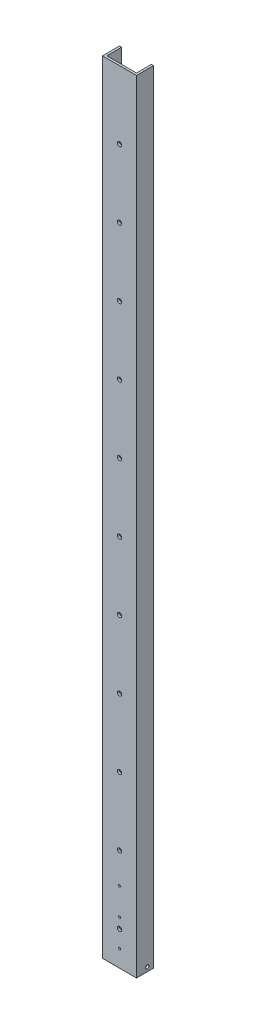
ISO-10303-21;
HEADER;
FILE_DESCRIPTION(('STEP AP214'),'2;1');
FILE_NAME('part.step','',(''),(''),'','','');
FILE_SCHEMA(('AUTOMOTIVE_DESIGN { 1 0 10303 214 1 1 1 1 }'));
ENDSEC;
DATA;
#1=APPLICATION_CONTEXT('core data for automotive mechanical design processes');
#2=APPLICATION_PROTOCOL_DEFINITION('international standard','automotive_design',2000,#1);
#3=PRODUCT_CONTEXT('',#1,'mechanical');
#4=PRODUCT('Part','Part','',(#3));
#5=PRODUCT_RELATED_PRODUCT_CATEGORY('part','',(#4));
#6=PRODUCT_DEFINITION_FORMATION('','',#4);
#7=PRODUCT_DEFINITION_CONTEXT('part definition',#1,'design');
#8=PRODUCT_DEFINITION('design','',#6,#7);
#9=PRODUCT_DEFINITION_SHAPE('','',#8);
#10=(LENGTH_UNIT() NAMED_UNIT(*) SI_UNIT(.MILLI.,.METRE.));
#11=(NAMED_UNIT(*) PLANE_ANGLE_UNIT() SI_UNIT($,.RADIAN.));
#12=(NAMED_UNIT(*) SI_UNIT($,.STERADIAN.) SOLID_ANGLE_UNIT());
#13=UNCERTAINTY_MEASURE_WITH_UNIT(LENGTH_MEASURE(1.E-05),#10,'distance_accuracy_value','');
#14=(GEOMETRIC_REPRESENTATION_CONTEXT(3) GLOBAL_UNCERTAINTY_ASSIGNED_CONTEXT((#13)) GLOBAL_UNIT_ASSIGNED_CONTEXT((#10,
#11,#12)) REPRESENTATION_CONTEXT('',''));
#15=CARTESIAN_POINT('',(0.,0.,0.));
#16=DIRECTION('',(0.,0.,1.));
#17=DIRECTION('',(1.,0.,0.));
#18=AXIS2_PLACEMENT_3D('',#15,#16,#17);
#19=CARTESIAN_POINT('',(0.,1168.4,0.));
#20=DIRECTION('',(1.,0.,0.));
#21=DIRECTION('',(0.,0.,-1.));
#22=AXIS2_PLACEMENT_3D('',#19,#20,#21);
#23=PLANE('',#22);
#24=CARTESIAN_POINT('',(0.,6.35,-15.875));
#25=DIRECTION('',(-1.,0.,0.));
#26=DIRECTION('',(0.,0.,1.));
#27=AXIS2_PLACEMENT_3D('',#24,#25,#26);
#28=CIRCLE('',#27,2.667);
#29=CARTESIAN_POINT('',(0.,6.35,-13.208));
#30=VERTEX_POINT('',#29);
#31=EDGE_CURVE('E332',#30,#30,#28,.T.);
#32=ORIENTED_EDGE('',*,*,#31,.F.);
#33=EDGE_LOOP('',(#32));
#34=FACE_BOUND('',#33,.T.);
#35=DIRECTION('',(0.,0.,1.));
#36=VECTOR('',#35,1.);
#37=CARTESIAN_POINT('',(0.,0.,0.));
#38=LINE('',#37,#36);
#39=CARTESIAN_POINT('',(0.,0.,-25.4));
#40=VERTEX_POINT('',#39);
#41=CARTESIAN_POINT('',(0.,0.,0.));
#42=VERTEX_POINT('',#41);
#43=EDGE_CURVE('E150',#40,#42,#38,.T.);
#44=ORIENTED_EDGE('',*,*,#43,.T.);
#45=DIRECTION('',(0.,-1.,0.));
#46=VECTOR('',#45,1.);
#47=CARTESIAN_POINT('',(0.,1168.4,0.));
#48=LINE('',#47,#46);
#49=CARTESIAN_POINT('',(0.,1168.4,0.));
#50=VERTEX_POINT('',#49);
#51=EDGE_CURVE('E11',#50,#42,#48,.T.);
#52=ORIENTED_EDGE('',*,*,#51,.F.);
#53=DIRECTION('',(0.,0.,1.));
#54=VECTOR('',#53,1.);
#55=CARTESIAN_POINT('',(0.,1168.4,0.));
#56=LINE('',#55,#54);
#57=CARTESIAN_POINT('',(0.,1168.4,-25.4));
#58=VERTEX_POINT('',#57);
#59=EDGE_CURVE('E173',#58,#50,#56,.T.);
#60=ORIENTED_EDGE('',*,*,#59,.F.);
#61=DIRECTION('',(0.,-1.,0.));
#62=VECTOR('',#61,1.);
#63=CARTESIAN_POINT('',(0.,1168.4,-25.4));
#64=LINE('',#63,#62);
#65=EDGE_CURVE('E146',#58,#40,#64,.T.);
#66=ORIENTED_EDGE('',*,*,#65,.T.);
#67=EDGE_LOOP('',(#44,#52,#60,#66));
#68=FACE_BOUND('',#67,.T.);
#69=ADVANCED_FACE('F38',(#34,#68),#23,.F.);
#70=CARTESIAN_POINT('',(0.,1168.4,0.));
#71=DIRECTION('',(0.,0.,-1.));
#72=DIRECTION('',(-1.,0.,0.));
#73=AXIS2_PLACEMENT_3D('',#70,#71,#72);
#74=PLANE('',#73);
#75=CARTESIAN_POINT('',(25.4,25.4,0.));
#76=DIRECTION('',(0.,0.,-1.));
#77=DIRECTION('',(-1.,0.,0.));
#78=AXIS2_PLACEMENT_3D('',#75,#76,#77);
#79=CIRCLE('',#78,1.5875);
#80=CARTESIAN_POINT('',(23.8125,25.4,0.));
#81=VERTEX_POINT('',#80);
#82=EDGE_CURVE('E227',#81,#81,#79,.F.);
#83=ORIENTED_EDGE('',*,*,#82,.F.);
#84=EDGE_LOOP('',(#83));
#85=FACE_BOUND('',#84,.T.);
#86=CARTESIAN_POINT('',(25.4,66.0202958789237,0.));
#87=DIRECTION('',(0.,0.,-1.));
#88=DIRECTION('',(-1.,0.,0.));
#89=AXIS2_PLACEMENT_3D('',#86,#87,#88);
#90=CIRCLE('',#89,1.5875);
#91=CARTESIAN_POINT('',(23.8125,66.0202958789237,0.));
#92=VERTEX_POINT('',#91);
#93=EDGE_CURVE('E315',#92,#92,#90,.F.);
#94=ORIENTED_EDGE('',*,*,#93,.F.);
#95=EDGE_LOOP('',(#94));
#96=FACE_BOUND('',#95,.T.);
#97=CARTESIAN_POINT('',(25.4,106.640591757847,0.));
#98=DIRECTION('',(0.,0.,-1.));
#99=DIRECTION('',(-1.,0.,0.));
#100=AXIS2_PLACEMENT_3D('',#97,#98,#99);
#101=CIRCLE('',#100,1.5875);
#102=CARTESIAN_POINT('',(23.8125,106.640591757847,0.));
#103=VERTEX_POINT('',#102);
#104=EDGE_CURVE('E305',#103,#103,#101,.F.);
#105=ORIENTED_EDGE('',*,*,#104,.F.);
#106=EDGE_LOOP('',(#105));
#107=FACE_BOUND('',#106,.T.);
#108=CARTESIAN_POINT('',(25.4,50.8,0.));
#109=DIRECTION('',(0.,0.,1.));
#110=DIRECTION('',(1.,0.,0.));
#111=AXIS2_PLACEMENT_3D('',#108,#109,#110);
#112=CIRCLE('',#111,3.175);
#113=CARTESIAN_POINT('',(28.575,50.8,0.));
#114=VERTEX_POINT('',#113);
#115=EDGE_CURVE('E296',#114,#114,#112,.T.);
#116=ORIENTED_EDGE('',*,*,#115,.F.);
#117=EDGE_LOOP('',(#116));
#118=FACE_BOUND('',#117,.T.);
#119=CARTESIAN_POINT('',(25.4,152.4,0.));
#120=DIRECTION('',(0.,0.,1.));
#121=DIRECTION('',(1.,0.,0.));
#122=AXIS2_PLACEMENT_3D('',#119,#120,#121);
#123=CIRCLE('',#122,3.175);
#124=CARTESIAN_POINT('',(28.575,152.4,0.));
#125=VERTEX_POINT('',#124);
#126=EDGE_CURVE('E288',#125,#125,#123,.T.);
#127=ORIENTED_EDGE('',*,*,#126,.F.);
#128=EDGE_LOOP('',(#127));
#129=FACE_BOUND('',#128,.T.);
#130=CARTESIAN_POINT('',(25.4,254.,0.));
#131=DIRECTION('',(0.,0.,1.));
#132=DIRECTION('',(1.,0.,0.));
#133=AXIS2_PLACEMENT_3D('',#130,#131,#132);
#134=CIRCLE('',#133,3.175);
#135=CARTESIAN_POINT('',(28.575,254.,0.));
#136=VERTEX_POINT('',#135);
#137=EDGE_CURVE('E280',#136,#136,#134,.T.);
#138=ORIENTED_EDGE('',*,*,#137,.F.);
#139=EDGE_LOOP('',(#138));
#140=FACE_BOUND('',#139,.T.);
#141=CARTESIAN_POINT('',(25.4,355.6,0.));
#142=DIRECTION('',(0.,0.,1.));
#143=DIRECTION('',(1.,0.,0.));
#144=AXIS2_PLACEMENT_3D('',#141,#142,#143);
#145=CIRCLE('',#144,3.17499999999997);
#146=CARTESIAN_POINT('',(28.575,355.6,0.));
#147=VERTEX_POINT('',#146);
#148=EDGE_CURVE('E272',#147,#147,#145,.T.);
#149=ORIENTED_EDGE('',*,*,#148,.F.);
#150=EDGE_LOOP('',(#149));
#151=FACE_BOUND('',#150,.T.);
#152=CARTESIAN_POINT('',(25.4,457.2,0.));
#153=DIRECTION('',(0.,0.,1.));
#154=DIRECTION('',(1.,0.,0.));
#155=AXIS2_PLACEMENT_3D('',#152,#153,#154);
#156=CIRCLE('',#155,3.17500000000002);
#157=CARTESIAN_POINT('',(28.575,457.2,0.));
#158=VERTEX_POINT('',#157);
#159=EDGE_CURVE('E264',#158,#158,#156,.T.);
#160=ORIENTED_EDGE('',*,*,#159,.F.);
#161=EDGE_LOOP('',(#160));
#162=FACE_BOUND('',#161,.T.);
#163=CARTESIAN_POINT('',(25.4,558.8,0.));
#164=DIRECTION('',(0.,0.,1.));
#165=DIRECTION('',(1.,0.,0.));
#166=AXIS2_PLACEMENT_3D('',#163,#164,#165);
#167=CIRCLE('',#166,3.175);
#168=CARTESIAN_POINT('',(28.575,558.8,0.));
#169=VERTEX_POINT('',#168);
#170=EDGE_CURVE('E256',#169,#169,#167,.T.);
#171=ORIENTED_EDGE('',*,*,#170,.F.);
#172=EDGE_LOOP('',(#171));
#173=FACE_BOUND('',#172,.T.);
#174=CARTESIAN_POINT('',(25.4,660.4,0.));
#175=DIRECTION('',(0.,0.,1.));
#176=DIRECTION('',(1.,0.,0.));
#177=AXIS2_PLACEMENT_3D('',#174,#175,#176);
#178=CIRCLE('',#177,3.175);
#179=CARTESIAN_POINT('',(28.575,660.4,0.));
#180=VERTEX_POINT('',#179);
#181=EDGE_CURVE('E248',#180,#180,#178,.T.);
#182=ORIENTED_EDGE('',*,*,#181,.F.);
#183=EDGE_LOOP('',(#182));
#184=FACE_BOUND('',#183,.T.);
#185=CARTESIAN_POINT('',(25.4,762.,0.));
#186=DIRECTION('',(0.,0.,1.));
#187=DIRECTION('',(1.,0.,0.));
#188=AXIS2_PLACEMENT_3D('',#185,#186,#187);
#189=CIRCLE('',#188,3.175);
#190=CARTESIAN_POINT('',(28.575,762.,0.));
#191=VERTEX_POINT('',#190);
#192=EDGE_CURVE('E240',#191,#191,#189,.T.);
#193=ORIENTED_EDGE('',*,*,#192,.F.);
#194=EDGE_LOOP('',(#193));
#195=FACE_BOUND('',#194,.T.);
#196=CARTESIAN_POINT('',(25.4,863.6,0.));
#197=DIRECTION('',(0.,0.,1.));
#198=DIRECTION('',(1.,0.,0.));
#199=AXIS2_PLACEMENT_3D('',#196,#197,#198);
#200=CIRCLE('',#199,3.175);
#201=CARTESIAN_POINT('',(28.575,863.6,0.));
#202=VERTEX_POINT('',#201);
#203=EDGE_CURVE('E232',#202,#202,#200,.T.);
#204=ORIENTED_EDGE('',*,*,#203,.F.);
#205=EDGE_LOOP('',(#204));
#206=FACE_BOUND('',#205,.T.);
#207=CARTESIAN_POINT('',(25.4,965.2,0.));
#208=DIRECTION('',(0.,0.,1.));
#209=DIRECTION('',(1.,0.,0.));
#210=AXIS2_PLACEMENT_3D('',#207,#208,#209);
#211=CIRCLE('',#210,3.175);
#212=CARTESIAN_POINT('',(28.575,965.2,0.));
#213=VERTEX_POINT('',#212);
#214=EDGE_CURVE('E223',#213,#213,#211,.T.);
#215=ORIENTED_EDGE('',*,*,#214,.F.);
#216=EDGE_LOOP('',(#215));
#217=FACE_BOUND('',#216,.T.);
#218=CARTESIAN_POINT('',(25.4,1066.8,0.));
#219=DIRECTION('',(0.,0.,1.));
#220=DIRECTION('',(1.,0.,0.));
#221=AXIS2_PLACEMENT_3D('',#218,#219,#220);
#222=CIRCLE('',#221,3.17499999999994);
#223=CARTESIAN_POINT('',(28.5749999999999,1066.8,0.));
#224=VERTEX_POINT('',#223);
#225=EDGE_CURVE('E224',#224,#224,#222,.T.);
#226=ORIENTED_EDGE('',*,*,#225,.F.);
#227=EDGE_LOOP('',(#226));
#228=FACE_BOUND('',#227,.T.);
#229=DIRECTION('',(1.,0.,0.));
#230=VECTOR('',#229,1.);
#231=CARTESIAN_POINT('',(0.,0.,0.));
#232=LINE('',#231,#230);
#233=CARTESIAN_POINT('',(50.8,0.,0.));
#234=VERTEX_POINT('',#233);
#235=EDGE_CURVE('E154',#42,#234,#232,.T.);
#236=ORIENTED_EDGE('',*,*,#235,.T.);
#237=DIRECTION('',(0.,-1.,0.));
#238=VECTOR('',#237,1.);
#239=CARTESIAN_POINT('',(50.8,1168.4,0.));
#240=LINE('',#239,#238);
#241=CARTESIAN_POINT('',(50.8,1168.4,0.));
#242=VERTEX_POINT('',#241);
#243=EDGE_CURVE('E48',#242,#234,#240,.T.);
#244=ORIENTED_EDGE('',*,*,#243,.F.);
#245=DIRECTION('',(1.,0.,0.));
#246=VECTOR('',#245,1.);
#247=CARTESIAN_POINT('',(0.,1168.4,0.));
#248=LINE('',#247,#246);
#249=EDGE_CURVE('E107',#50,#242,#248,.T.);
#250=ORIENTED_EDGE('',*,*,#249,.F.);
#251=ORIENTED_EDGE('',*,*,#51,.T.);
#252=EDGE_LOOP('',(#236,#244,#250,#251));
#253=FACE_BOUND('',#252,.T.);
#254=ADVANCED_FACE('F361',(#85,#96,#107,#118,#129,#140,#151,#162,#173,#184,#195,#206,#217,#228,
#253),#74,.F.);
#255=CARTESIAN_POINT('',(50.8,1168.4,0.));
#256=DIRECTION('',(-1.,0.,0.));
#257=DIRECTION('',(0.,0.,1.));
#258=AXIS2_PLACEMENT_3D('',#255,#256,#257);
#259=PLANE('',#258);
#260=CARTESIAN_POINT('',(50.8,6.35,-15.875));
#261=DIRECTION('',(-1.,0.,0.));
#262=DIRECTION('',(0.,0.,1.));
#263=AXIS2_PLACEMENT_3D('',#260,#261,#262);
#264=CIRCLE('',#263,2.667);
#265=CARTESIAN_POINT('',(50.8,6.35,-13.208));
#266=VERTEX_POINT('',#265);
#267=EDGE_CURVE('E336',#266,#266,#264,.T.);
#268=ORIENTED_EDGE('',*,*,#267,.T.);
#269=EDGE_LOOP('',(#268));
#270=FACE_BOUND('',#269,.T.);
#271=DIRECTION('',(0.,0.,-1.));
#272=VECTOR('',#271,1.);
#273=CARTESIAN_POINT('',(50.8,0.,0.));
#274=LINE('',#273,#272);
#275=CARTESIAN_POINT('',(50.8,0.,-25.4));
#276=VERTEX_POINT('',#275);
#277=EDGE_CURVE('E158',#234,#276,#274,.T.);
#278=ORIENTED_EDGE('',*,*,#277,.T.);
#279=DIRECTION('',(0.,-1.,0.));
#280=VECTOR('',#279,1.);
#281=CARTESIAN_POINT('',(50.8,1168.4,-25.4));
#282=LINE('',#281,#280);
#283=CARTESIAN_POINT('',(50.8,1168.4,-25.4));
#284=VERTEX_POINT('',#283);
#285=EDGE_CURVE('E184',#284,#276,#282,.T.);
#286=ORIENTED_EDGE('',*,*,#285,.F.);
#287=DIRECTION('',(0.,0.,-1.));
#288=VECTOR('',#287,1.);
#289=CARTESIAN_POINT('',(50.8,1168.4,0.));
#290=LINE('',#289,#288);
#291=EDGE_CURVE('E196',#242,#284,#290,.T.);
#292=ORIENTED_EDGE('',*,*,#291,.F.);
#293=ORIENTED_EDGE('',*,*,#243,.T.);
#294=EDGE_LOOP('',(#278,#286,#292,#293));
#295=FACE_BOUND('',#294,.T.);
#296=ADVANCED_FACE('F194',(#270,#295),#259,.F.);
#297=CARTESIAN_POINT('',(50.8,1168.4,-25.4));
#298=DIRECTION('',(0.,0.,1.));
#299=DIRECTION('',(1.,0.,0.));
#300=AXIS2_PLACEMENT_3D('',#297,#298,#299);
#301=PLANE('',#300);
#302=DIRECTION('',(-1.,0.,0.));
#303=VECTOR('',#302,1.);
#304=CARTESIAN_POINT('',(50.8,0.,-25.4));
#305=LINE('',#304,#303);
#306=CARTESIAN_POINT('',(47.625,0.,-25.4));
#307=VERTEX_POINT('',#306);
#308=EDGE_CURVE('E161',#276,#307,#305,.T.);
#309=ORIENTED_EDGE('',*,*,#308,.T.);
#310=DIRECTION('',(0.,-1.,0.));
#311=VECTOR('',#310,1.);
#312=CARTESIAN_POINT('',(47.625,1168.4,-25.4));
#313=LINE('',#312,#311);
#314=CARTESIAN_POINT('',(47.625,1168.4,-25.4));
#315=VERTEX_POINT('',#314);
#316=EDGE_CURVE('E180',#315,#307,#313,.T.);
#317=ORIENTED_EDGE('',*,*,#316,.F.);
#318=DIRECTION('',(-1.,0.,0.));
#319=VECTOR('',#318,1.);
#320=CARTESIAN_POINT('',(50.8,1168.4,-25.4));
#321=LINE('',#320,#319);
#322=EDGE_CURVE('E209',#284,#315,#321,.T.);
#323=ORIENTED_EDGE('',*,*,#322,.F.);
#324=ORIENTED_EDGE('',*,*,#285,.T.);
#325=EDGE_LOOP('',(#309,#317,#323,#324));
#326=FACE_BOUND('',#325,.T.);
#327=ADVANCED_FACE('F204',(#326),#301,.F.);
#328=CARTESIAN_POINT('',(47.625,1168.4,-3.175));
#329=DIRECTION('',(1.,0.,0.));
#330=DIRECTION('',(0.,0.,-1.));
#331=AXIS2_PLACEMENT_3D('',#328,#329,#330);
#332=PLANE('',#331);
#333=CARTESIAN_POINT('',(47.625,6.35,-15.875));
#334=DIRECTION('',(1.,0.,0.));
#335=DIRECTION('',(0.,0.,-1.));
#336=AXIS2_PLACEMENT_3D('',#333,#334,#335);
#337=CIRCLE('',#336,2.667);
#338=CARTESIAN_POINT('',(47.625,6.35,-18.542));
#339=VERTEX_POINT('',#338);
#340=EDGE_CURVE('E314',#339,#339,#337,.T.);
#341=ORIENTED_EDGE('',*,*,#340,.T.);
#342=EDGE_LOOP('',(#341));
#343=FACE_BOUND('',#342,.T.);
#344=DIRECTION('',(0.,0.,1.));
#345=VECTOR('',#344,1.);
#346=CARTESIAN_POINT('',(47.625,0.,-3.175));
#347=LINE('',#346,#345);
#348=CARTESIAN_POINT('',(47.625,0.,-3.175));
#349=VERTEX_POINT('',#348);
#350=EDGE_CURVE('E164',#307,#349,#347,.T.);
#351=ORIENTED_EDGE('',*,*,#350,.T.);
#352=DIRECTION('',(0.,-1.,0.));
#353=VECTOR('',#352,1.);
#354=CARTESIAN_POINT('',(47.625,1168.4,-3.175));
#355=LINE('',#354,#353);
#356=CARTESIAN_POINT('',(47.625,1168.4,-3.175));
#357=VERTEX_POINT('',#356);
#358=EDGE_CURVE('E141',#357,#349,#355,.T.);
#359=ORIENTED_EDGE('',*,*,#358,.F.);
#360=DIRECTION('',(0.,0.,1.));
#361=VECTOR('',#360,1.);
#362=CARTESIAN_POINT('',(47.625,1168.4,-3.175));
#363=LINE('',#362,#361);
#364=EDGE_CURVE('E130',#315,#357,#363,.T.);
#365=ORIENTED_EDGE('',*,*,#364,.F.);
#366=ORIENTED_EDGE('',*,*,#316,.T.);
#367=EDGE_LOOP('',(#351,#359,#365,#366));
#368=FACE_BOUND('',#367,.T.);
#369=ADVANCED_FACE('F207',(#343,#368),#332,.F.);
#370=CARTESIAN_POINT('',(3.175,1168.4,-3.175));
#371=DIRECTION('',(0.,0.,1.));
#372=DIRECTION('',(1.,0.,0.));
#373=AXIS2_PLACEMENT_3D('',#370,#371,#372);
#374=PLANE('',#373);
#375=CARTESIAN_POINT('',(25.4,25.4,-3.175));
#376=DIRECTION('',(0.,0.,-1.));
#377=DIRECTION('',(-1.,0.,0.));
#378=AXIS2_PLACEMENT_3D('',#375,#376,#377);
#379=CIRCLE('',#378,1.5875);
#380=CARTESIAN_POINT('',(23.8125,25.4,-3.175));
#381=VERTEX_POINT('',#380);
#382=EDGE_CURVE('E319',#381,#381,#379,.T.);
#383=ORIENTED_EDGE('',*,*,#382,.F.);
#384=EDGE_LOOP('',(#383));
#385=FACE_BOUND('',#384,.T.);
#386=CARTESIAN_POINT('',(25.4,66.0202958789237,-3.175));
#387=DIRECTION('',(0.,0.,-1.));
#388=DIRECTION('',(-1.,0.,0.));
#389=AXIS2_PLACEMENT_3D('',#386,#387,#388);
#390=CIRCLE('',#389,1.5875);
#391=CARTESIAN_POINT('',(23.8125,66.0202958789237,-3.175));
#392=VERTEX_POINT('',#391);
#393=EDGE_CURVE('E309',#392,#392,#390,.T.);
#394=ORIENTED_EDGE('',*,*,#393,.F.);
#395=EDGE_LOOP('',(#394));
#396=FACE_BOUND('',#395,.T.);
#397=CARTESIAN_POINT('',(25.4,106.640591757847,-3.175));
#398=DIRECTION('',(0.,0.,-1.));
#399=DIRECTION('',(-1.,0.,0.));
#400=AXIS2_PLACEMENT_3D('',#397,#398,#399);
#401=CIRCLE('',#400,1.5875);
#402=CARTESIAN_POINT('',(23.8125,106.640591757847,-3.175));
#403=VERTEX_POINT('',#402);
#404=EDGE_CURVE('E310',#403,#403,#401,.T.);
#405=ORIENTED_EDGE('',*,*,#404,.F.);
#406=EDGE_LOOP('',(#405));
#407=FACE_BOUND('',#406,.T.);
#408=CARTESIAN_POINT('',(25.4,50.8,-3.175));
#409=DIRECTION('',(0.,0.,1.));
#410=DIRECTION('',(1.,0.,0.));
#411=AXIS2_PLACEMENT_3D('',#408,#409,#410);
#412=CIRCLE('',#411,3.175);
#413=CARTESIAN_POINT('',(28.575,50.8,-3.175));
#414=VERTEX_POINT('',#413);
#415=EDGE_CURVE('E155',#414,#414,#412,.F.);
#416=ORIENTED_EDGE('',*,*,#415,.F.);
#417=EDGE_LOOP('',(#416));
#418=FACE_BOUND('',#417,.T.);
#419=CARTESIAN_POINT('',(25.4,152.4,-3.175));
#420=DIRECTION('',(0.,0.,1.));
#421=DIRECTION('',(1.,0.,0.));
#422=AXIS2_PLACEMENT_3D('',#419,#420,#421);
#423=CIRCLE('',#422,3.175);
#424=CARTESIAN_POINT('',(28.575,152.4,-3.175));
#425=VERTEX_POINT('',#424);
#426=EDGE_CURVE('E292',#425,#425,#423,.F.);
#427=ORIENTED_EDGE('',*,*,#426,.F.);
#428=EDGE_LOOP('',(#427));
#429=FACE_BOUND('',#428,.T.);
#430=CARTESIAN_POINT('',(25.4,254.,-3.175));
#431=DIRECTION('',(0.,0.,1.));
#432=DIRECTION('',(1.,0.,0.));
#433=AXIS2_PLACEMENT_3D('',#430,#431,#432);
#434=CIRCLE('',#433,3.175);
#435=CARTESIAN_POINT('',(28.575,254.,-3.175));
#436=VERTEX_POINT('',#435);
#437=EDGE_CURVE('E284',#436,#436,#434,.F.);
#438=ORIENTED_EDGE('',*,*,#437,.F.);
#439=EDGE_LOOP('',(#438));
#440=FACE_BOUND('',#439,.T.);
#441=CARTESIAN_POINT('',(25.4,355.6,-3.175));
#442=DIRECTION('',(0.,0.,1.));
#443=DIRECTION('',(1.,0.,0.));
#444=AXIS2_PLACEMENT_3D('',#441,#442,#443);
#445=CIRCLE('',#444,3.17499999999997);
#446=CARTESIAN_POINT('',(28.575,355.6,-3.175));
#447=VERTEX_POINT('',#446);
#448=EDGE_CURVE('E276',#447,#447,#445,.F.);
#449=ORIENTED_EDGE('',*,*,#448,.F.);
#450=EDGE_LOOP('',(#449));
#451=FACE_BOUND('',#450,.T.);
#452=CARTESIAN_POINT('',(25.4,457.2,-3.175));
#453=DIRECTION('',(0.,0.,1.));
#454=DIRECTION('',(1.,0.,0.));
#455=AXIS2_PLACEMENT_3D('',#452,#453,#454);
#456=CIRCLE('',#455,3.17500000000002);
#457=CARTESIAN_POINT('',(28.575,457.2,-3.175));
#458=VERTEX_POINT('',#457);
#459=EDGE_CURVE('E268',#458,#458,#456,.F.);
#460=ORIENTED_EDGE('',*,*,#459,.F.);
#461=EDGE_LOOP('',(#460));
#462=FACE_BOUND('',#461,.T.);
#463=CARTESIAN_POINT('',(25.4,558.8,-3.175));
#464=DIRECTION('',(0.,0.,1.));
#465=DIRECTION('',(1.,0.,0.));
#466=AXIS2_PLACEMENT_3D('',#463,#464,#465);
#467=CIRCLE('',#466,3.175);
#468=CARTESIAN_POINT('',(28.575,558.8,-3.175));
#469=VERTEX_POINT('',#468);
#470=EDGE_CURVE('E260',#469,#469,#467,.F.);
#471=ORIENTED_EDGE('',*,*,#470,.F.);
#472=EDGE_LOOP('',(#471));
#473=FACE_BOUND('',#472,.T.);
#474=CARTESIAN_POINT('',(25.4,660.4,-3.175));
#475=DIRECTION('',(0.,0.,1.));
#476=DIRECTION('',(1.,0.,0.));
#477=AXIS2_PLACEMENT_3D('',#474,#475,#476);
#478=CIRCLE('',#477,3.175);
#479=CARTESIAN_POINT('',(28.575,660.4,-3.175));
#480=VERTEX_POINT('',#479);
#481=EDGE_CURVE('E252',#480,#480,#478,.F.);
#482=ORIENTED_EDGE('',*,*,#481,.F.);
#483=EDGE_LOOP('',(#482));
#484=FACE_BOUND('',#483,.T.);
#485=CARTESIAN_POINT('',(25.4,762.,-3.175));
#486=DIRECTION('',(0.,0.,1.));
#487=DIRECTION('',(1.,0.,0.));
#488=AXIS2_PLACEMENT_3D('',#485,#486,#487);
#489=CIRCLE('',#488,3.175);
#490=CARTESIAN_POINT('',(28.575,762.,-3.175));
#491=VERTEX_POINT('',#490);
#492=EDGE_CURVE('E244',#491,#491,#489,.F.);
#493=ORIENTED_EDGE('',*,*,#492,.F.);
#494=EDGE_LOOP('',(#493));
#495=FACE_BOUND('',#494,.T.);
#496=CARTESIAN_POINT('',(25.4,863.6,-3.175));
#497=DIRECTION('',(0.,0.,1.));
#498=DIRECTION('',(1.,0.,0.));
#499=AXIS2_PLACEMENT_3D('',#496,#497,#498);
#500=CIRCLE('',#499,3.175);
#501=CARTESIAN_POINT('',(28.575,863.6,-3.175));
#502=VERTEX_POINT('',#501);
#503=EDGE_CURVE('E236',#502,#502,#500,.F.);
#504=ORIENTED_EDGE('',*,*,#503,.F.);
#505=EDGE_LOOP('',(#504));
#506=FACE_BOUND('',#505,.T.);
#507=CARTESIAN_POINT('',(25.4,965.2,-3.175));
#508=DIRECTION('',(0.,0.,1.));
#509=DIRECTION('',(1.,0.,0.));
#510=AXIS2_PLACEMENT_3D('',#507,#508,#509);
#511=CIRCLE('',#510,3.175);
#512=CARTESIAN_POINT('',(28.575,965.2,-3.175));
#513=VERTEX_POINT('',#512);
#514=EDGE_CURVE('E228',#513,#513,#511,.F.);
#515=ORIENTED_EDGE('',*,*,#514,.F.);
#516=EDGE_LOOP('',(#515));
#517=FACE_BOUND('',#516,.T.);
#518=CARTESIAN_POINT('',(25.4,1066.8,-3.175));
#519=DIRECTION('',(0.,0.,1.));
#520=DIRECTION('',(1.,0.,0.));
#521=AXIS2_PLACEMENT_3D('',#518,#519,#520);
#522=CIRCLE('',#521,3.17499999999994);
#523=CARTESIAN_POINT('',(28.5749999999999,1066.8,-3.175));
#524=VERTEX_POINT('',#523);
#525=EDGE_CURVE('E219',#524,#524,#522,.F.);
#526=ORIENTED_EDGE('',*,*,#525,.F.);
#527=EDGE_LOOP('',(#526));
#528=FACE_BOUND('',#527,.T.);
#529=DIRECTION('',(-1.,0.,0.));
#530=VECTOR('',#529,1.);
#531=CARTESIAN_POINT('',(3.175,0.,-3.175));
#532=LINE('',#531,#530);
#533=CARTESIAN_POINT('',(3.175,0.,-3.175));
#534=VERTEX_POINT('',#533);
#535=EDGE_CURVE('E139',#349,#534,#532,.T.);
#536=ORIENTED_EDGE('',*,*,#535,.T.);
#537=DIRECTION('',(0.,-1.,0.));
#538=VECTOR('',#537,1.);
#539=CARTESIAN_POINT('',(3.175,1168.4,-3.175));
#540=LINE('',#539,#538);
#541=CARTESIAN_POINT('',(3.175,1168.4,-3.175));
#542=VERTEX_POINT('',#541);
#543=EDGE_CURVE('E136',#542,#534,#540,.T.);
#544=ORIENTED_EDGE('',*,*,#543,.F.);
#545=DIRECTION('',(-1.,0.,0.));
#546=VECTOR('',#545,1.);
#547=CARTESIAN_POINT('',(3.175,1168.4,-3.175));
#548=LINE('',#547,#546);
#549=EDGE_CURVE('E124',#357,#542,#548,.T.);
#550=ORIENTED_EDGE('',*,*,#549,.F.);
#551=ORIENTED_EDGE('',*,*,#358,.T.);
#552=EDGE_LOOP('',(#536,#544,#550,#551));
#553=FACE_BOUND('',#552,.T.);
#554=ADVANCED_FACE('F137',(#385,#396,#407,#418,#429,#440,#451,#462,#473,#484,#495,#506,#517,
#528,#553),#374,.F.);
#555=CARTESIAN_POINT('',(3.175,1168.4,-3.175));
#556=DIRECTION('',(-1.,0.,0.));
#557=DIRECTION('',(0.,0.,1.));
#558=AXIS2_PLACEMENT_3D('',#555,#556,#557);
#559=PLANE('',#558);
#560=CARTESIAN_POINT('',(3.175,6.35,-15.875));
#561=DIRECTION('',(-1.,0.,0.));
#562=DIRECTION('',(0.,0.,1.));
#563=AXIS2_PLACEMENT_3D('',#560,#561,#562);
#564=CIRCLE('',#563,2.667);
#565=CARTESIAN_POINT('',(3.175,6.35,-13.208));
#566=VERTEX_POINT('',#565);
#567=EDGE_CURVE('E41',#566,#566,#564,.T.);
#568=ORIENTED_EDGE('',*,*,#567,.T.);
#569=EDGE_LOOP('',(#568));
#570=FACE_BOUND('',#569,.T.);
#571=DIRECTION('',(0.,0.,-1.));
#572=VECTOR('',#571,1.);
#573=CARTESIAN_POINT('',(3.175,0.,-3.175));
#574=LINE('',#573,#572);
#575=CARTESIAN_POINT('',(3.175,0.,-25.4));
#576=VERTEX_POINT('',#575);
#577=EDGE_CURVE('E93',#534,#576,#574,.T.);
#578=ORIENTED_EDGE('',*,*,#577,.T.);
#579=DIRECTION('',(0.,-1.,0.));
#580=VECTOR('',#579,1.);
#581=CARTESIAN_POINT('',(3.175,1168.4,-25.4));
#582=LINE('',#581,#580);
#583=CARTESIAN_POINT('',(3.175,1168.4,-25.4));
#584=VERTEX_POINT('',#583);
#585=EDGE_CURVE('E142',#584,#576,#582,.T.);
#586=ORIENTED_EDGE('',*,*,#585,.F.);
#587=DIRECTION('',(0.,0.,-1.));
#588=VECTOR('',#587,1.);
#589=CARTESIAN_POINT('',(3.175,1168.4,-3.175));
#590=LINE('',#589,#588);
#591=EDGE_CURVE('E128',#542,#584,#590,.T.);
#592=ORIENTED_EDGE('',*,*,#591,.F.);
#593=ORIENTED_EDGE('',*,*,#543,.T.);
#594=EDGE_LOOP('',(#578,#586,#592,#593));
#595=FACE_BOUND('',#594,.T.);
#596=ADVANCED_FACE('F144',(#570,#595),#559,.F.);
#597=CARTESIAN_POINT('',(0.,1168.4,-25.4));
#598=DIRECTION('',(0.,0.,1.));
#599=DIRECTION('',(1.,0.,0.));
#600=AXIS2_PLACEMENT_3D('',#597,#598,#599);
#601=PLANE('',#600);
#602=DIRECTION('',(-1.,0.,0.));
#603=VECTOR('',#602,1.);
#604=CARTESIAN_POINT('',(0.,0.,-25.4));
#605=LINE('',#604,#603);
#606=EDGE_CURVE('E99',#576,#40,#605,.T.);
#607=ORIENTED_EDGE('',*,*,#606,.T.);
#608=ORIENTED_EDGE('',*,*,#65,.F.);
#609=DIRECTION('',(-1.,0.,0.));
#610=VECTOR('',#609,1.);
#611=CARTESIAN_POINT('',(0.,1168.4,-25.4));
#612=LINE('',#611,#610);
#613=EDGE_CURVE('E56',#584,#58,#612,.T.);
#614=ORIENTED_EDGE('',*,*,#613,.F.);
#615=ORIENTED_EDGE('',*,*,#585,.T.);
#616=EDGE_LOOP('',(#607,#608,#614,#615));
#617=FACE_BOUND('',#616,.T.);
#618=ADVANCED_FACE('F371',(#617),#601,.F.);
#619=CARTESIAN_POINT('',(0.,1168.4,0.));
#620=DIRECTION('',(0.,-1.,0.));
#621=DIRECTION('',(0.,0.,-1.));
#622=AXIS2_PLACEMENT_3D('',#619,#620,#621);
#623=PLANE('',#622);
#624=ORIENTED_EDGE('',*,*,#59,.T.);
#625=ORIENTED_EDGE('',*,*,#249,.T.);
#626=ORIENTED_EDGE('',*,*,#291,.T.);
#627=ORIENTED_EDGE('',*,*,#322,.T.);
#628=ORIENTED_EDGE('',*,*,#364,.T.);
#629=ORIENTED_EDGE('',*,*,#549,.T.);
#630=ORIENTED_EDGE('',*,*,#591,.T.);
#631=ORIENTED_EDGE('',*,*,#613,.T.);
#632=EDGE_LOOP('',(#624,#625,#626,#627,#628,#629,#630,#631));
#633=FACE_BOUND('',#632,.T.);
#634=ADVANCED_FACE('F126',(#633),#623,.F.);
#635=CARTESIAN_POINT('',(0.,0.,0.));
#636=DIRECTION('',(0.,-1.,0.));
#637=DIRECTION('',(0.,0.,-1.));
#638=AXIS2_PLACEMENT_3D('',#635,#636,#637);
#639=PLANE('',#638);
#640=ORIENTED_EDGE('',*,*,#43,.F.);
#641=ORIENTED_EDGE('',*,*,#606,.F.);
#642=ORIENTED_EDGE('',*,*,#577,.F.);
#643=ORIENTED_EDGE('',*,*,#535,.F.);
#644=ORIENTED_EDGE('',*,*,#350,.F.);
#645=ORIENTED_EDGE('',*,*,#308,.F.);
#646=ORIENTED_EDGE('',*,*,#277,.F.);
#647=ORIENTED_EDGE('',*,*,#235,.F.);
#648=EDGE_LOOP('',(#640,#641,#642,#643,#644,#645,#646,#647));
#649=FACE_BOUND('',#648,.T.);
#650=ADVANCED_FACE('F200',(#649),#639,.T.);
#651=CARTESIAN_POINT('',(25.4,1066.8,-25.401));
#652=DIRECTION('',(0.,0.,1.));
#653=DIRECTION('',(1.,0.,0.));
#654=AXIS2_PLACEMENT_3D('',#651,#652,#653);
#655=CYLINDRICAL_SURFACE('',#654,3.17499999999994);
#656=ORIENTED_EDGE('',*,*,#225,.T.);
#657=EDGE_LOOP('',(#656));
#658=FACE_BOUND('',#657,.T.);
#659=ORIENTED_EDGE('',*,*,#525,.T.);
#660=EDGE_LOOP('',(#659));
#661=FACE_BOUND('',#660,.T.);
#662=ADVANCED_FACE('F455',(#658,#661),#655,.F.);
#663=CARTESIAN_POINT('',(25.4,965.2,-25.401));
#664=DIRECTION('',(0.,0.,1.));
#665=DIRECTION('',(1.,0.,0.));
#666=AXIS2_PLACEMENT_3D('',#663,#664,#665);
#667=CYLINDRICAL_SURFACE('',#666,3.175);
#668=ORIENTED_EDGE('',*,*,#214,.T.);
#669=EDGE_LOOP('',(#668));
#670=FACE_BOUND('',#669,.T.);
#671=ORIENTED_EDGE('',*,*,#514,.T.);
#672=EDGE_LOOP('',(#671));
#673=FACE_BOUND('',#672,.T.);
#674=ADVANCED_FACE('F462',(#670,#673),#667,.F.);
#675=CARTESIAN_POINT('',(25.4,863.6,-25.401));
#676=DIRECTION('',(0.,0.,1.));
#677=DIRECTION('',(1.,0.,0.));
#678=AXIS2_PLACEMENT_3D('',#675,#676,#677);
#679=CYLINDRICAL_SURFACE('',#678,3.175);
#680=ORIENTED_EDGE('',*,*,#203,.T.);
#681=EDGE_LOOP('',(#680));
#682=FACE_BOUND('',#681,.T.);
#683=ORIENTED_EDGE('',*,*,#503,.T.);
#684=EDGE_LOOP('',(#683));
#685=FACE_BOUND('',#684,.T.);
#686=ADVANCED_FACE('F471',(#682,#685),#679,.F.);
#687=CARTESIAN_POINT('',(25.4,762.,-25.401));
#688=DIRECTION('',(0.,0.,1.));
#689=DIRECTION('',(1.,0.,0.));
#690=AXIS2_PLACEMENT_3D('',#687,#688,#689);
#691=CYLINDRICAL_SURFACE('',#690,3.175);
#692=ORIENTED_EDGE('',*,*,#192,.T.);
#693=EDGE_LOOP('',(#692));
#694=FACE_BOUND('',#693,.T.);
#695=ORIENTED_EDGE('',*,*,#492,.T.);
#696=EDGE_LOOP('',(#695));
#697=FACE_BOUND('',#696,.T.);
#698=ADVANCED_FACE('F480',(#694,#697),#691,.F.);
#699=CARTESIAN_POINT('',(25.4,660.4,-25.401));
#700=DIRECTION('',(0.,0.,1.));
#701=DIRECTION('',(1.,0.,0.));
#702=AXIS2_PLACEMENT_3D('',#699,#700,#701);
#703=CYLINDRICAL_SURFACE('',#702,3.175);
#704=ORIENTED_EDGE('',*,*,#181,.T.);
#705=EDGE_LOOP('',(#704));
#706=FACE_BOUND('',#705,.T.);
#707=ORIENTED_EDGE('',*,*,#481,.T.);
#708=EDGE_LOOP('',(#707));
#709=FACE_BOUND('',#708,.T.);
#710=ADVANCED_FACE('F489',(#706,#709),#703,.F.);
#711=CARTESIAN_POINT('',(25.4,558.8,-25.401));
#712=DIRECTION('',(0.,0.,1.));
#713=DIRECTION('',(1.,0.,0.));
#714=AXIS2_PLACEMENT_3D('',#711,#712,#713);
#715=CYLINDRICAL_SURFACE('',#714,3.175);
#716=ORIENTED_EDGE('',*,*,#170,.T.);
#717=EDGE_LOOP('',(#716));
#718=FACE_BOUND('',#717,.T.);
#719=ORIENTED_EDGE('',*,*,#470,.T.);
#720=EDGE_LOOP('',(#719));
#721=FACE_BOUND('',#720,.T.);
#722=ADVANCED_FACE('F498',(#718,#721),#715,.F.);
#723=CARTESIAN_POINT('',(25.4,457.2,-25.401));
#724=DIRECTION('',(0.,0.,1.));
#725=DIRECTION('',(1.,0.,0.));
#726=AXIS2_PLACEMENT_3D('',#723,#724,#725);
#727=CYLINDRICAL_SURFACE('',#726,3.17500000000002);
#728=ORIENTED_EDGE('',*,*,#159,.T.);
#729=EDGE_LOOP('',(#728));
#730=FACE_BOUND('',#729,.T.);
#731=ORIENTED_EDGE('',*,*,#459,.T.);
#732=EDGE_LOOP('',(#731));
#733=FACE_BOUND('',#732,.T.);
#734=ADVANCED_FACE('F507',(#730,#733),#727,.F.);
#735=CARTESIAN_POINT('',(25.4,355.6,-25.401));
#736=DIRECTION('',(0.,0.,1.));
#737=DIRECTION('',(1.,0.,0.));
#738=AXIS2_PLACEMENT_3D('',#735,#736,#737);
#739=CYLINDRICAL_SURFACE('',#738,3.17499999999997);
#740=ORIENTED_EDGE('',*,*,#148,.T.);
#741=EDGE_LOOP('',(#740));
#742=FACE_BOUND('',#741,.T.);
#743=ORIENTED_EDGE('',*,*,#448,.T.);
#744=EDGE_LOOP('',(#743));
#745=FACE_BOUND('',#744,.T.);
#746=ADVANCED_FACE('F517',(#742,#745),#739,.F.);
#747=CARTESIAN_POINT('',(25.4,254.,-25.401));
#748=DIRECTION('',(0.,0.,1.));
#749=DIRECTION('',(1.,0.,0.));
#750=AXIS2_PLACEMENT_3D('',#747,#748,#749);
#751=CYLINDRICAL_SURFACE('',#750,3.175);
#752=ORIENTED_EDGE('',*,*,#137,.T.);
#753=EDGE_LOOP('',(#752));
#754=FACE_BOUND('',#753,.T.);
#755=ORIENTED_EDGE('',*,*,#437,.T.);
#756=EDGE_LOOP('',(#755));
#757=FACE_BOUND('',#756,.T.);
#758=ADVANCED_FACE('F526',(#754,#757),#751,.F.);
#759=CARTESIAN_POINT('',(25.4,152.4,-25.401));
#760=DIRECTION('',(0.,0.,1.));
#761=DIRECTION('',(1.,0.,0.));
#762=AXIS2_PLACEMENT_3D('',#759,#760,#761);
#763=CYLINDRICAL_SURFACE('',#762,3.175);
#764=ORIENTED_EDGE('',*,*,#126,.T.);
#765=EDGE_LOOP('',(#764));
#766=FACE_BOUND('',#765,.T.);
#767=ORIENTED_EDGE('',*,*,#426,.T.);
#768=EDGE_LOOP('',(#767));
#769=FACE_BOUND('',#768,.T.);
#770=ADVANCED_FACE('F535',(#766,#769),#763,.F.);
#771=CARTESIAN_POINT('',(25.4,50.8,-25.401));
#772=DIRECTION('',(0.,0.,1.));
#773=DIRECTION('',(1.,0.,0.));
#774=AXIS2_PLACEMENT_3D('',#771,#772,#773);
#775=CYLINDRICAL_SURFACE('',#774,3.175);
#776=ORIENTED_EDGE('',*,*,#115,.T.);
#777=EDGE_LOOP('',(#776));
#778=FACE_BOUND('',#777,.T.);
#779=ORIENTED_EDGE('',*,*,#415,.T.);
#780=EDGE_LOOP('',(#779));
#781=FACE_BOUND('',#780,.T.);
#782=ADVANCED_FACE('F544',(#778,#781),#775,.F.);
#783=CARTESIAN_POINT('',(25.4,106.640591757847,0.00100000000000013));
#784=DIRECTION('',(0.,0.,-1.));
#785=DIRECTION('',(-1.,0.,0.));
#786=AXIS2_PLACEMENT_3D('',#783,#784,#785);
#787=CYLINDRICAL_SURFACE('',#786,1.5875);
#788=ORIENTED_EDGE('',*,*,#404,.T.);
#789=EDGE_LOOP('',(#788));
#790=FACE_BOUND('',#789,.T.);
#791=ORIENTED_EDGE('',*,*,#104,.T.);
#792=EDGE_LOOP('',(#791));
#793=FACE_BOUND('',#792,.T.);
#794=ADVANCED_FACE('F553',(#790,#793),#787,.F.);
#795=CARTESIAN_POINT('',(25.4,66.0202958789237,0.00100000000000013));
#796=DIRECTION('',(0.,0.,-1.));
#797=DIRECTION('',(-1.,0.,0.));
#798=AXIS2_PLACEMENT_3D('',#795,#796,#797);
#799=CYLINDRICAL_SURFACE('',#798,1.5875);
#800=ORIENTED_EDGE('',*,*,#393,.T.);
#801=EDGE_LOOP('',(#800));
#802=FACE_BOUND('',#801,.T.);
#803=ORIENTED_EDGE('',*,*,#93,.T.);
#804=EDGE_LOOP('',(#803));
#805=FACE_BOUND('',#804,.T.);
#806=ADVANCED_FACE('F357',(#802,#805),#799,.F.);
#807=CARTESIAN_POINT('',(25.4,25.4,0.00100000000000013));
#808=DIRECTION('',(0.,0.,-1.));
#809=DIRECTION('',(-1.,0.,0.));
#810=AXIS2_PLACEMENT_3D('',#807,#808,#809);
#811=CYLINDRICAL_SURFACE('',#810,1.5875);
#812=ORIENTED_EDGE('',*,*,#382,.T.);
#813=EDGE_LOOP('',(#812));
#814=FACE_BOUND('',#813,.T.);
#815=ORIENTED_EDGE('',*,*,#82,.T.);
#816=EDGE_LOOP('',(#815));
#817=FACE_BOUND('',#816,.T.);
#818=ADVANCED_FACE('F349',(#814,#817),#811,.F.);
#819=CARTESIAN_POINT('',(50.8,6.35,-15.875));
#820=DIRECTION('',(-1.,0.,0.));
#821=DIRECTION('',(0.,0.,1.));
#822=AXIS2_PLACEMENT_3D('',#819,#820,#821);
#823=CYLINDRICAL_SURFACE('',#822,2.667);
#824=ORIENTED_EDGE('',*,*,#31,.T.);
#825=EDGE_LOOP('',(#824));
#826=FACE_BOUND('',#825,.T.);
#827=ORIENTED_EDGE('',*,*,#567,.F.);
#828=EDGE_LOOP('',(#827));
#829=FACE_BOUND('',#828,.T.);
#830=ADVANCED_FACE('F346',(#826,#829),#823,.F.);
#831=ORIENTED_EDGE('',*,*,#267,.F.);
#832=EDGE_LOOP('',(#831));
#833=FACE_BOUND('',#832,.T.);
#834=ORIENTED_EDGE('',*,*,#340,.F.);
#835=EDGE_LOOP('',(#834));
#836=FACE_BOUND('',#835,.T.);
#837=ADVANCED_FACE('F348',(#833,#836),#823,.F.);
#838=CLOSED_SHELL('',(#69,#254,#296,#327,#369,#554,#596,#618,#634,#650,#662,#674,#686,#698,#710,
#722,#734,#746,#758,#770,#782,#794,#806,#818,#830,#837));
#839=MANIFOLD_SOLID_BREP('B2',#838);
#840=ADVANCED_BREP_SHAPE_REPRESENTATION('',(#18,#839),#14);
#841=SHAPE_DEFINITION_REPRESENTATION(#9,#840);
ENDSEC;
END-ISO-10303-21;
